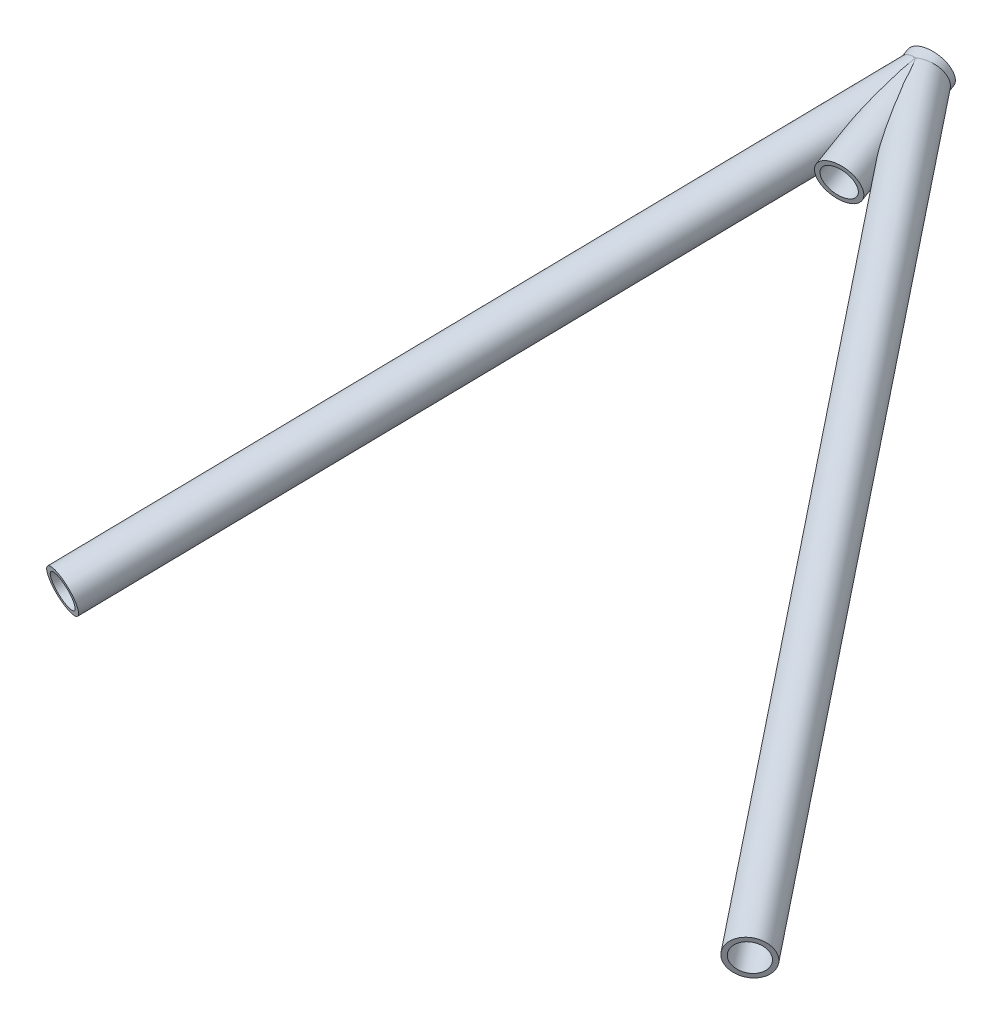
ISO-10303-21;
HEADER;
FILE_DESCRIPTION(('STEP AP214'),'2;1');
FILE_NAME('part.step','',(''),(''),'','','');
FILE_SCHEMA(('AUTOMOTIVE_DESIGN { 1 0 10303 214 1 1 1 1 }'));
ENDSEC;
DATA;
#1=APPLICATION_CONTEXT('core data for automotive mechanical design processes');
#2=APPLICATION_PROTOCOL_DEFINITION('international standard','automotive_design',2000,#1);
#3=PRODUCT_CONTEXT('',#1,'mechanical');
#4=PRODUCT('Part','Part','',(#3));
#5=PRODUCT_RELATED_PRODUCT_CATEGORY('part','',(#4));
#6=PRODUCT_DEFINITION_FORMATION('','',#4);
#7=PRODUCT_DEFINITION_CONTEXT('part definition',#1,'design');
#8=PRODUCT_DEFINITION('design','',#6,#7);
#9=PRODUCT_DEFINITION_SHAPE('','',#8);
#10=(LENGTH_UNIT() NAMED_UNIT(*) SI_UNIT(.MILLI.,.METRE.));
#11=(NAMED_UNIT(*) PLANE_ANGLE_UNIT() SI_UNIT($,.RADIAN.));
#12=(NAMED_UNIT(*) SI_UNIT($,.STERADIAN.) SOLID_ANGLE_UNIT());
#13=UNCERTAINTY_MEASURE_WITH_UNIT(LENGTH_MEASURE(1.E-05),#10,'distance_accuracy_value','');
#14=(GEOMETRIC_REPRESENTATION_CONTEXT(3) GLOBAL_UNCERTAINTY_ASSIGNED_CONTEXT((#13)) GLOBAL_UNIT_ASSIGNED_CONTEXT((#10,
#11,#12)) REPRESENTATION_CONTEXT('',''));
#15=CARTESIAN_POINT('',(0.,0.,0.));
#16=DIRECTION('',(0.,0.,1.));
#17=DIRECTION('',(1.,0.,0.));
#18=AXIS2_PLACEMENT_3D('',#15,#16,#17);
#19=CARTESIAN_POINT('',(1696.18593125395,298.313265774571,-609.984435723737));
#20=DIRECTION('',(0.586936783063146,-0.193365264339262,0.786202955498447));
#21=DIRECTION('',(0.801326519780633,0.,-0.598227221627584));
#22=AXIS2_PLACEMENT_3D('',#19,#20,#21);
#23=CYLINDRICAL_SURFACE('',#22,7.41679999999998);
#24=CARTESIAN_POINT('',(1929.45721259279,221.462462961638,-297.517103442446));
#25=DIRECTION('',(-0.586936783063146,0.193365264339262,-0.786202955498447));
#26=DIRECTION('',(-0.801326519780633,0.,0.598227221627584));
#27=AXIS2_PLACEMENT_3D('',#24,#25,#26);
#28=CIRCLE('',#27,7.41679999999998);
#29=CARTESIAN_POINT('',(1923.51393406088,221.462462961638,-293.080171785078));
#30=VERTEX_POINT('',#29);
#31=EDGE_CURVE('E67',#30,#30,#28,.T.);
#32=ORIENTED_EDGE('',*,*,#31,.F.);
#33=EDGE_LOOP('',(#32));
#34=FACE_BOUND('',#33,.T.);
#35=CARTESIAN_POINT('',(1706.02165747647,297.030905904922,-609.207426175195));
#36=CARTESIAN_POINT('',(1706.00673581778,296.841103519044,-609.227413273846));
#37=CARTESIAN_POINT('',(1705.98733985814,296.650978769853,-609.241045880463));
#38=CARTESIAN_POINT('',(1705.94016060306,296.271275535075,-609.255083840829));
#39=CARTESIAN_POINT('',(1705.9123770868,296.081697064004,-609.255488846298));
#40=CARTESIAN_POINT('',(1705.84919796562,295.704240280113,-609.242515598167));
#41=CARTESIAN_POINT('',(1705.81380072679,295.516362341264,-609.229134383668));
#42=CARTESIAN_POINT('',(1705.73641681489,295.14355209084,-609.188016254505));
#43=CARTESIAN_POINT('',(1705.69443019386,294.958619756022,-609.160279453176));
#44=CARTESIAN_POINT('',(1705.60500902473,294.592385171832,-609.089806818607));
#45=CARTESIAN_POINT('',(1705.55755916885,294.411094880365,-609.047028115088));
#46=CARTESIAN_POINT('',(1705.45885005154,294.053922003974,-608.946028945467));
#47=CARTESIAN_POINT('',(1705.40759079152,293.878039417044,-608.88780848509));
#48=CARTESIAN_POINT('',(1705.30308733114,293.53302727902,-608.755697301747));
#49=CARTESIAN_POINT('',(1705.24984467361,293.363892682493,-608.681818557565));
#50=CARTESIAN_POINT('',(1705.14330876726,293.033396564212,-608.518375530838));
#51=CARTESIAN_POINT('',(1705.09001552187,292.872034548503,-608.428812246744));
#52=CARTESIAN_POINT('',(1704.9879771568,292.565761111547,-608.23915137407));
#53=CARTESIAN_POINT('',(1704.93913696643,292.420431215509,-608.139780057658));
#54=CARTESIAN_POINT('',(1704.84496671516,292.138435012884,-607.927966292064));
#55=CARTESIAN_POINT('',(1704.79963640467,292.001768090361,-607.815524773787));
#56=CARTESIAN_POINT('',(1704.71399469042,291.737586982934,-607.578731415712));
#57=CARTESIAN_POINT('',(1704.67368147738,291.610069505586,-607.454383898296));
#58=CARTESIAN_POINT('',(1704.59921102269,291.364273460401,-607.19516722167));
#59=CARTESIAN_POINT('',(1704.56505451786,291.245995999343,-607.060296805872));
#60=CARTESIAN_POINT('',(1704.49602406218,290.990197697765,-606.746909387567));
#61=CARTESIAN_POINT('',(1704.46308950023,290.855219295926,-606.565886912209));
#62=CARTESIAN_POINT('',(1704.40863425189,290.598581230814,-606.193029772949));
#63=CARTESIAN_POINT('',(1704.38711699707,290.476925580502,-606.001191877536));
#64=CARTESIAN_POINT('',(1704.35524231705,290.245407469113,-605.609097016551));
#65=CARTESIAN_POINT('',(1704.3449108679,290.135572989478,-605.40882157173));
#66=CARTESIAN_POINT('',(1704.33474768124,289.926576611459,-605.002592836891));
#67=CARTESIAN_POINT('',(1704.33491552798,289.827414290628,-604.796639772022));
#68=CARTESIAN_POINT('',(1704.34546053741,289.624377059148,-604.350148388296));
#69=CARTESIAN_POINT('',(1704.35733891784,289.521962016027,-604.108986924925));
#70=CARTESIAN_POINT('',(1704.39194877607,289.327304572146,-603.623312143065));
#71=CARTESIAN_POINT('',(1704.41468461181,289.235066274433,-603.378797516998));
#72=CARTESIAN_POINT('',(1704.46949120538,289.059033999311,-602.887385294032));
#73=CARTESIAN_POINT('',(1704.50157641049,288.975253363104,-602.640484585225));
#74=CARTESIAN_POINT('',(1704.57367149723,288.814977347645,-602.145539495427));
#75=CARTESIAN_POINT('',(1704.61368041333,288.738481082462,-601.897495257369));
#76=CARTESIAN_POINT('',(1704.70070277427,288.591242530618,-601.399212768991));
#77=CARTESIAN_POINT('',(1704.74775842362,288.520539183174,-601.148970493799));
#78=CARTESIAN_POINT('',(1704.8476641574,288.384570506553,-600.648173056871));
#79=CARTESIAN_POINT('',(1704.90051435279,288.319305281554,-600.397617889236));
#80=CARTESIAN_POINT('',(1705.01110306714,288.193603704696,-599.896632614133));
#81=CARTESIAN_POINT('',(1705.06883717548,288.133163089674,-599.646202594999));
#82=CARTESIAN_POINT('',(1705.18852293979,288.016527603164,-599.145367932158));
#83=CARTESIAN_POINT('',(1705.25047460521,287.960332741183,-598.894963288508));
#84=CARTESIAN_POINT('',(1705.38808010555,287.843199643747,-598.354660789383));
#85=CARTESIAN_POINT('',(1705.46435165202,287.782916286716,-598.064778625151));
#86=CARTESIAN_POINT('',(1705.62098996646,287.667023501027,-597.485182064215));
#87=CARTESIAN_POINT('',(1705.70135690703,287.611414269645,-597.195467675104));
#88=CARTESIAN_POINT('',(1705.94765250895,287.451033614131,-596.326516883562));
#89=CARTESIAN_POINT('',(1706.11875695,287.352724913273,-595.74754613239));
#90=CARTESIAN_POINT('',(1706.47110520859,287.171548314561,-594.589550732133));
#91=CARTESIAN_POINT('',(1706.65236090523,287.088699019974,-594.010526846369));
#92=CARTESIAN_POINT('',(1707.02209947316,286.93802506366,-592.852894680539));
#93=CARTESIAN_POINT('',(1707.21058169521,286.870199055929,-592.274286367874));
#94=CARTESIAN_POINT('',(1707.59246434981,286.749890463263,-591.117994085909));
#95=CARTESIAN_POINT('',(1707.78585763146,286.697386820126,-590.540309943514));
#96=CARTESIAN_POINT('',(1708.17618712582,286.608601588453,-589.384831406686));
#97=CARTESIAN_POINT('',(1708.37312360939,286.572321245674,-588.807037007195));
#98=CARTESIAN_POINT('',(1708.76884935907,286.517887406104,-587.651988106915));
#99=CARTESIAN_POINT('',(1708.96763610266,286.499712088531,-587.074733795968));
#100=CARTESIAN_POINT('',(1709.36585764206,286.484402892454,-585.920230744267));
#101=CARTESIAN_POINT('',(1709.56529232166,286.487265428812,-585.342982019326));
#102=CARTESIAN_POINT('',(1709.92434349182,286.515732490038,-584.301544890679));
#103=CARTESIAN_POINT('',(1710.08412654167,286.536784393966,-583.837302363674));
#104=CARTESIAN_POINT('',(1710.32253589936,286.583910962291,-583.141336189893));
#105=CARTESIAN_POINT('',(1710.401829734,286.602222856646,-582.90931082402));
#106=CARTESIAN_POINT('',(1710.55977926024,286.64474160028,-582.445580578367));
#107=CARTESIAN_POINT('',(1710.6384349676,286.668948303468,-582.213875690787));
#108=CARTESIAN_POINT('',(1710.79460151518,286.724031429803,-581.751758482221));
#109=CARTESIAN_POINT('',(1710.87211535122,286.754884755291,-581.521344450945));
#110=CARTESIAN_POINT('',(1711.02595160608,286.824433960921,-581.061307595501));
#111=CARTESIAN_POINT('',(1711.10227412188,286.86312919911,-580.831684708133));
#112=CARTESIAN_POINT('',(1711.25320225255,286.949809507487,-580.373947594193));
#113=CARTESIAN_POINT('',(1711.32780993863,286.997782631775,-580.145831813581));
#114=CARTESIAN_POINT('',(1711.47476981037,287.105072688683,-579.691583083834));
#115=CARTESIAN_POINT('',(1711.54712283632,287.164385334939,-579.465449419127));
#116=CARTESIAN_POINT('',(1711.66234858359,287.272609602529,-579.099760179352));
#117=CARTESIAN_POINT('',(1711.70619201726,287.317205412571,-578.959235356503));
#118=CARTESIAN_POINT('',(1711.79226987723,287.413056832389,-578.67990618022));
#119=CARTESIAN_POINT('',(1711.83450387985,287.464314180375,-578.541102286222));
#120=CARTESIAN_POINT('',(1711.91678843494,287.574642384202,-578.266247417052));
#121=CARTESIAN_POINT('',(1711.95684273,287.633699209502,-578.130191992748));
#122=CARTESIAN_POINT('',(1712.0341229033,287.76129777923,-577.86182145355));
#123=CARTESIAN_POINT('',(1712.07135048488,287.829833740236,-577.729504116803));
#124=CARTESIAN_POINT('',(1712.14415679505,287.983104737118,-577.462361580691));
#125=CARTESIAN_POINT('',(1712.17949155459,288.068578983069,-577.327886500858));
#126=CARTESIAN_POINT('',(1712.24394632056,288.255738715878,-577.068864806687));
#127=CARTESIAN_POINT('',(1712.27307051578,288.357413194898,-576.944311536202));
#128=CARTESIAN_POINT('',(1712.31676178159,288.555357291404,-576.737394655839));
#129=CARTESIAN_POINT('',(1712.33312563671,288.647804562354,-576.651807160795));
#130=CARTESIAN_POINT('',(1712.35855524456,288.845109744886,-576.495046582663));
#131=CARTESIAN_POINT('',(1712.36763565059,288.949942248802,-576.423844774669));
#132=CARTESIAN_POINT('',(1712.37606554908,289.152573284875,-576.31106599501));
#133=CARTESIAN_POINT('',(1712.37677858194,289.24865718231,-576.266534741664));
#134=CARTESIAN_POINT('',(1712.37142939253,289.446525748462,-576.193388794709));
#135=CARTESIAN_POINT('',(1712.365370577,289.548307526266,-576.164766108757));
#136=CARTESIAN_POINT('',(1712.34670248247,289.754335666234,-576.1242603837));
#137=CARTESIAN_POINT('',(1712.33410436199,289.858577542222,-576.11234895669));
#138=CARTESIAN_POINT('',(1712.30323170095,290.066821202277,-576.104097505337));
#139=CARTESIAN_POINT('',(1712.2849515195,290.17082264383,-576.107773000996));
#140=CARTESIAN_POINT('',(1712.23374349447,290.427091717086,-576.13364890604));
#141=CARTESIAN_POINT('',(1712.19803322785,290.577943414102,-576.164070528728));
#142=CARTESIAN_POINT('',(1712.11990691476,290.871661501556,-576.2468419912));
#143=CARTESIAN_POINT('',(1712.07747193579,291.014503757398,-576.299254451012));
#144=CARTESIAN_POINT('',(1711.99101913826,291.283312743292,-576.416036696457));
#145=CARTESIAN_POINT('',(1711.94725734547,291.40977722868,-576.479477794236));
#146=CARTESIAN_POINT('',(1711.85710419034,291.656081683409,-576.616653503584));
#147=CARTESIAN_POINT('',(1711.81071033497,291.775915152449,-576.690397974325));
#148=CARTESIAN_POINT('',(1711.71600798229,292.00991252984,-576.845839760501));
#149=CARTESIAN_POINT('',(1711.6676951672,292.124062178366,-576.927555692528));
#150=CARTESIAN_POINT('',(1711.56980114917,292.347085047603,-577.097028804988));
#151=CARTESIAN_POINT('',(1711.52022050266,292.45596052433,-577.184783362827));
#152=CARTESIAN_POINT('',(1711.38715304752,292.739401042865,-577.424522917533));
#153=CARTESIAN_POINT('',(1711.30284509883,292.909995013015,-577.580740213895));
#154=CARTESIAN_POINT('',(1711.13265204176,293.241122300947,-577.902754895929));
#155=CARTESIAN_POINT('',(1711.04676604302,293.401649698626,-578.068557810729));
#156=CARTESIAN_POINT('',(1710.87387441638,293.714609589258,-578.407710368127));
#157=CARTESIAN_POINT('',(1710.78686695639,293.867025959006,-578.581073880676));
#158=CARTESIAN_POINT('',(1710.61227074065,294.164767523639,-578.933511090491));
#159=CARTESIAN_POINT('',(1710.52468191809,294.31009188673,-579.112585453506));
#160=CARTESIAN_POINT('',(1710.34873284269,294.595385174957,-579.476300230731));
#161=CARTESIAN_POINT('',(1710.2603709514,294.735322101025,-579.660964865286));
#162=CARTESIAN_POINT('',(1710.0835185762,295.009834312928,-580.034179027311));
#163=CARTESIAN_POINT('',(1709.995028087,295.144409371163,-580.222728719179));
#164=CARTESIAN_POINT('',(1709.81817770761,295.408656306455,-580.602883213475));
#165=CARTESIAN_POINT('',(1709.72981779317,295.538334138427,-580.794483874426));
#166=CARTESIAN_POINT('',(1709.5532326434,295.793468518336,-581.180529418666));
#167=CARTESIAN_POINT('',(1709.46500740763,295.918925080448,-581.374974292404));
#168=CARTESIAN_POINT('',(1709.26753189215,296.195839263943,-581.813575179307));
#169=CARTESIAN_POINT('',(1709.15834361105,296.346268764314,-582.058408147956));
#170=CARTESIAN_POINT('',(1708.94047925172,296.641904198261,-582.551437404445));
#171=CARTESIAN_POINT('',(1708.83180319474,296.787109916689,-582.799633830235));
#172=CARTESIAN_POINT('',(1708.50672987952,297.215720168797,-583.548754145803));
#173=CARTESIAN_POINT('',(1708.29131526716,297.492079215525,-584.05414730699));
#174=CARTESIAN_POINT('',(1707.86394908448,298.029358806916,-585.075455900364));
#175=CARTESIAN_POINT('',(1707.65200262478,298.290257834289,-585.591384713585));
#176=CARTESIAN_POINT('',(1707.23308990091,298.798174372415,-586.631950672212));
#177=CARTESIAN_POINT('',(1707.02612319946,299.045193104549,-587.156587046127));
#178=CARTESIAN_POINT('',(1706.61935295359,299.525794468289,-588.212153464212));
#179=CARTESIAN_POINT('',(1706.41952630141,299.759422274003,-588.743054047122));
#180=CARTESIAN_POINT('',(1706.0281330771,300.214901758383,-589.812954910295));
#181=CARTESIAN_POINT('',(1705.83656722131,300.436752416183,-590.351955887538));
#182=CARTESIAN_POINT('',(1705.46447674254,300.86852222511,-591.43777069037));
#183=CARTESIAN_POINT('',(1705.28394023396,301.07845420233,-591.98457529332));
#184=CARTESIAN_POINT('',(1705.02404590805,301.38402632937,-592.811594497165));
#185=CARTESIAN_POINT('',(1704.93923824896,301.48432291872,-593.088383963408));
#186=CARTESIAN_POINT('',(1704.77388372001,301.681605867048,-593.644400902294));
#187=CARTESIAN_POINT('',(1704.69333675348,301.778592301101,-593.923628319463));
#188=CARTESIAN_POINT('',(1704.51192637859,301.999837866402,-594.575656713254));
#189=CARTESIAN_POINT('',(1704.41294215486,302.122745169429,-594.949446314826));
#190=CARTESIAN_POINT('',(1704.22590400146,302.361235219671,-595.70216356258));
#191=CARTESIAN_POINT('',(1704.13785201856,302.476816660527,-596.081092110605));
#192=CARTESIAN_POINT('',(1703.97560387456,302.698979875966,-596.844663910848));
#193=CARTESIAN_POINT('',(1703.90140957647,302.805560439425,-597.229307923957));
#194=CARTESIAN_POINT('',(1703.80350158889,302.956577499446,-597.810778757054));
#195=CARTESIAN_POINT('',(1703.77309814692,303.0054371836,-598.005336760058));
#196=CARTESIAN_POINT('',(1703.71736693563,303.099709635623,-598.396002873596));
#197=CARTESIAN_POINT('',(1703.69203886101,303.145122610715,-598.592110890157));
#198=CARTESIAN_POINT('',(1703.63920424214,303.247239092256,-599.055441149856));
#199=CARTESIAN_POINT('',(1703.61408758233,303.302265615709,-599.323317975052));
#200=CARTESIAN_POINT('',(1703.57632486432,303.402974452684,-599.861780445373));
#201=CARTESIAN_POINT('',(1703.56368020701,303.448655716066,-600.132366391346));
#202=CARTESIAN_POINT('',(1703.55302492076,303.527957835842,-600.675088985327));
#203=CARTESIAN_POINT('',(1703.55498424677,303.561603304246,-600.947221299288));
#204=CARTESIAN_POINT('',(1703.57560953296,303.613579630977,-601.492329313605));
#205=CARTESIAN_POINT('',(1703.59426754657,303.631917765739,-601.765304551261));
#206=CARTESIAN_POINT('',(1703.64166067538,303.646649213793,-602.229214343993));
#207=CARTESIAN_POINT('',(1703.66576557641,303.647938111784,-602.420468216501));
#208=CARTESIAN_POINT('',(1703.7232837008,303.639386832468,-602.801301179637));
#209=CARTESIAN_POINT('',(1703.75669390253,303.629550264671,-602.990880793351));
#210=CARTESIAN_POINT('',(1703.83263666698,303.597264495231,-603.36696882085));
#211=CARTESIAN_POINT('',(1703.87516104348,303.574826582806,-603.553479829994));
#212=CARTESIAN_POINT('',(1703.96867035452,303.516035149325,-603.922161590667));
#213=CARTESIAN_POINT('',(1704.01965520963,303.479681758911,-604.104332382926));
#214=CARTESIAN_POINT('',(1704.12921348921,303.391810975629,-604.464020979565));
#215=CARTESIAN_POINT('',(1704.18783416722,303.340196378838,-604.641500759702));
#216=CARTESIAN_POINT('',(1704.31066257574,303.221380345888,-604.989171276509));
#217=CARTESIAN_POINT('',(1704.37487047642,303.154178434865,-605.159361790927));
#218=CARTESIAN_POINT('',(1704.50685022478,303.004123904674,-605.491409264894));
#219=CARTESIAN_POINT('',(1704.57462459378,302.921260103077,-605.653260164318));
#220=CARTESIAN_POINT('',(1704.71149643146,302.740345560522,-605.967632819523));
#221=CARTESIAN_POINT('',(1704.7805938602,302.642295277433,-606.120154856373));
#222=CARTESIAN_POINT('',(1704.91207926615,302.440813402789,-606.402634675259));
#223=CARTESIAN_POINT('',(1704.97453495645,302.338562260688,-606.533406155521));
#224=CARTESIAN_POINT('',(1705.09725023908,302.122786528703,-606.786375396151));
#225=CARTESIAN_POINT('',(1705.15750999158,302.009262763299,-606.908573782442));
#226=CARTESIAN_POINT('',(1705.27449711503,301.771795643232,-607.144226055896));
#227=CARTESIAN_POINT('',(1705.33122431584,301.647851787407,-607.257679521963));
#228=CARTESIAN_POINT('',(1705.43998907526,301.390465951181,-607.475716984243));
#229=CARTESIAN_POINT('',(1705.49202637474,301.257023446708,-607.580300490372));
#230=CARTESIAN_POINT('',(1705.59352103876,300.972956739631,-607.786768650459));
#231=CARTESIAN_POINT('',(1705.64261233877,300.821779859197,-607.888073409145));
#232=CARTESIAN_POINT('',(1705.73344819626,300.510927862242,-608.08042097972));
#233=CARTESIAN_POINT('',(1705.77519243856,300.351252381524,-608.171463351307));
#234=CARTESIAN_POINT('',(1705.85059754308,300.024558911171,-608.343132168399));
#235=CARTESIAN_POINT('',(1705.88425818011,299.857540717134,-608.423758323696));
#236=CARTESIAN_POINT('',(1705.94295375268,299.517322246039,-608.57439571225));
#237=CARTESIAN_POINT('',(1705.96798890052,299.344122121244,-608.644407206726));
#238=CARTESIAN_POINT('',(1706.00856653463,298.997084885626,-608.771957469955));
#239=CARTESIAN_POINT('',(1706.02433090875,298.823372195914,-608.829764537273));
#240=CARTESIAN_POINT('',(1706.04716569101,298.472146667269,-608.934808525344));
#241=CARTESIAN_POINT('',(1706.05423280684,298.294632415119,-608.98204143775));
#242=CARTESIAN_POINT('',(1706.05965577032,297.936913822987,-609.065589878692));
#243=CARTESIAN_POINT('',(1706.05801127669,297.756709377892,-609.101904979462));
#244=CARTESIAN_POINT('',(1706.04616714856,297.394737048595,-609.163234889436));
#245=CARTESIAN_POINT('',(1706.03597075834,297.212969783147,-609.188253978397));
#246=CARTESIAN_POINT('',(1706.02165747647,297.030905904922,-609.207426175195));
#247=B_SPLINE_CURVE_WITH_KNOTS('',3,(#35,#36,#37,#38,#39,#40,#41,#42,#43,#44,#45,#46,#47,#48,
#49,#50,#51,#52,#53,#54,#55,#56,#57,#58,#59,#60,#61,#62,#63,#64,#65,#66,#67,#68,#69,#70,#71,#72,
#73,#74,#75,#76,#77,#78,#79,#80,#81,#82,#83,#84,#85,#86,#87,#88,#89,#90,#91,#92,#93,#94,#95,#96,
#97,#98,#99,#100,#101,#102,#103,#104,#105,#106,#107,#108,#109,#110,#111,#112,#113,#114,#115,
#116,#117,#118,#119,#120,#121,#122,#123,#124,#125,#126,#127,#128,#129,#130,#131,#132,#133,#134,
#135,#136,#137,#138,#139,#140,#141,#142,#143,#144,#145,#146,#147,#148,#149,#150,#151,#152,#153,
#154,#155,#156,#157,#158,#159,#160,#161,#162,#163,#164,#165,#166,#167,#168,#169,#170,#171,#172,
#173,#174,#175,#176,#177,#178,#179,#180,#181,#182,#183,#184,#185,#186,#187,#188,#189,#190,#191,
#192,#193,#194,#195,#196,#197,#198,#199,#200,#201,#202,#203,#204,#205,#206,#207,#208,#209,#210,
#211,#212,#213,#214,#215,#216,#217,#218,#219,#220,#221,#222,#223,#224,#225,#226,#227,#228,#229,
#230,#231,#232,#233,#234,#235,#236,#237,#238,#239,#240,#241,#242,#243,#244,#245,#246),
.UNSPECIFIED.,.T.,.F.,(4,2,2,2,2,2,2,2,2,2,2,2,2,2,2,2,2,2,2,2,2,2,2,2,2,2,2,2,2,2,2,2,2,2,2,2,
2,2,2,2,2,2,2,2,2,2,2,2,2,2,2,2,2,2,2,2,2,2,2,2,2,2,2,2,2,2,2,2,2,2,2,2,2,2,2,2,2,2,2,2,2,2,2,2,
2,2,2,2,2,2,2,2,2,2,2,2,2,2,2,2,2,2,2,2,2,4),(0.,0.574151275382462,1.14831766800678,
1.72260740137623,2.296892600893,2.87282799279553,3.44876317115333,4.02425933197849,
4.59971887104737,5.14712857839256,5.69449932114901,6.24167209321343,6.78891030602429,
7.47242075871127,8.15613652935075,8.84143666399751,9.52670966171098,10.3129926627842,
11.0995915267926,11.8874124032728,12.6751373416048,13.4677842361595,14.2604463120172,
15.0524000320317,15.8443555253407,16.7615301813815,17.6787435284927,19.5134019947082,
21.3502541791536,23.1869417250939,25.0210930128394,26.8553851173875,28.6874637870278,
30.5192302527021,31.9931047554359,32.7306971522825,33.4682712713172,34.2033224460803,
34.9383134725017,35.6723643744238,36.4061383500634,36.8674478385666,37.3288779401915,
37.7894889992185,38.2498202593181,38.7385918041611,39.2270326407056,39.6069008107843,
39.9860028075153,40.3022625540152,40.6183632700834,40.9339263637531,41.2498037394128,
41.7210220392224,42.1935913627706,42.6372242234307,43.0812845358824,43.5264079361407,
43.9713392233644,44.70935405677,45.4477989196802,46.1876606828538,46.927609013856,
47.6714288978679,48.4152803217858,49.1581960318027,49.9011092472057,50.8232310969298,
51.745390881927,53.5899441500655,55.4370071241908,57.2839073127778,59.1241577876502,
60.9645675194093,62.8029576451338,63.7220281708869,64.6410778379327,65.8580786438684,
67.0752958603398,68.2926766009728,68.9012654897403,69.5098177602161,70.3332966156811,
71.1568679558482,71.9787454149558,72.8002319667779,73.3780667227969,73.9557140616899,
74.5328447249371,75.1099699700809,75.6908533584024,76.2717544454759,76.8530718675366,
77.4343717664691,77.9658767475643,78.4973428829746,79.0288345942676,79.5603556525165,
80.12518725201,80.6900430761221,81.2549146343663,81.8197722892924,82.3704935408063,
82.9214232021492,83.4723744464766,84.0231167746117),.UNSPECIFIED.);
#248=CARTESIAN_POINT('',(1706.02165747647,297.030905904922,-609.207426175195));
#249=VERTEX_POINT('',#248);
#250=EDGE_CURVE('E81',#249,#249,#247,.T.);
#251=ORIENTED_EDGE('',*,*,#250,.T.);
#252=EDGE_LOOP('',(#251));
#253=FACE_BOUND('',#252,.T.);
#254=ADVANCED_FACE('F63',(#34,#253),#23,.F.);
#255=CARTESIAN_POINT('',(1695.27005223557,299.62724687487,-614.720955468418));
#256=DIRECTION('',(0.18317580367567,-0.262796220059855,0.94730394893615));
#257=DIRECTION('',(0.,-0.963608030897897,-0.267319215151245));
#258=AXIS2_PLACEMENT_3D('',#255,#256,#257);
#259=CYLINDRICAL_SURFACE('',#258,9.52499999999994);
#260=ORIENTED_EDGE('',*,*,#250,.F.);
#261=EDGE_LOOP('',(#260));
#262=FACE_BOUND('',#261,.T.);
#263=CARTESIAN_POINT('',(1696.18593125395,298.313265774571,-609.984435723738));
#264=DIRECTION('',(0.394737380314413,-0.233815149177805,0.88854537115303));
#265=DIRECTION('',(0.917171793543887,0.157717356150483,-0.365952369436776));
#266=AXIS2_PLACEMENT_3D('',#263,#264,#265);
#267=ELLIPSE('',#266,9.76447759000189,9.52499999999998);
#268=CARTESIAN_POINT('',(1695.66611562887,307.451587268054,-607.348814924447));
#269=VERTEX_POINT('',#268);
#270=CARTESIAN_POINT('',(1696.70574687903,289.174944281087,-612.620056523029));
#271=VERTEX_POINT('',#270);
#272=EDGE_CURVE('E72',#269,#271,#267,.F.);
#273=ORIENTED_EDGE('',*,*,#272,.T.);
#274=CARTESIAN_POINT('',(1696.18593125395,298.313265774571,-609.984435723738));
#275=DIRECTION('',(0.917171793543887,0.157717356150483,-0.365952369436776));
#276=DIRECTION('',(0.394737380314413,-0.233815149177805,0.88854537115303));
#277=AXIS2_PLACEMENT_3D('',#274,#275,#276);
#278=ELLIPSE('',#277,43.2734304674934,9.52499999999998);
#279=EDGE_CURVE('E13',#271,#269,#278,.F.);
#280=ORIENTED_EDGE('',*,*,#279,.T.);
#281=EDGE_LOOP('',(#273,#280));
#282=FACE_BOUND('',#281,.T.);
#283=ADVANCED_FACE('F79',(#262,#282),#259,.F.);
#284=CARTESIAN_POINT('',(1696.18593125395,298.313265774571,-609.984435723737));
#285=DIRECTION('',(0.586936783063146,-0.193365264339262,0.786202955498447));
#286=DIRECTION('',(0.801326519780633,0.,-0.598227221627584));
#287=AXIS2_PLACEMENT_3D('',#284,#285,#286);
#288=CYLINDRICAL_SURFACE('',#287,9.52500000000001);
#289=CARTESIAN_POINT('',(1929.45721259279,221.462462961638,-297.517103442446));
#290=DIRECTION('',(-0.586936783063146,0.193365264339262,-0.786202955498447));
#291=DIRECTION('',(-0.801326519780633,0.,0.598227221627584));
#292=AXIS2_PLACEMENT_3D('',#289,#290,#291);
#293=CIRCLE('',#292,9.52500000000001);
#294=CARTESIAN_POINT('',(1921.82457749188,221.462462961638,-291.818989156443));
#295=VERTEX_POINT('',#294);
#296=EDGE_CURVE('E107',#295,#295,#293,.T.);
#297=ORIENTED_EDGE('',*,*,#296,.T.);
#298=EDGE_LOOP('',(#297));
#299=FACE_BOUND('',#298,.T.);
#300=ORIENTED_EDGE('',*,*,#272,.F.);
#301=ORIENTED_EDGE('',*,*,#279,.F.);
#302=EDGE_LOOP('',(#300,#301));
#303=FACE_BOUND('',#302,.T.);
#304=ADVANCED_FACE('F65',(#299,#303),#288,.T.);
#305=CARTESIAN_POINT('',(1929.45721259279,221.462462961638,-297.517103442446));
#306=DIRECTION('',(-0.586936783063146,0.193365264339262,-0.786202955498447));
#307=DIRECTION('',(-0.801326519780633,0.,0.598227221627584));
#308=AXIS2_PLACEMENT_3D('',#305,#306,#307);
#309=PLANE('',#308);
#310=ORIENTED_EDGE('',*,*,#31,.T.);
#311=EDGE_LOOP('',(#310));
#312=FACE_BOUND('',#311,.T.);
#313=ORIENTED_EDGE('',*,*,#296,.F.);
#314=EDGE_LOOP('',(#313));
#315=FACE_BOUND('',#314,.T.);
#316=ADVANCED_FACE('F84',(#312,#315),#309,.F.);
#317=CLOSED_SHELL('',(#254,#283,#304,#316));
#318=MANIFOLD_SOLID_BREP('B2',#317);
#319=CARTESIAN_POINT('',(1600.,194.785610189008,-270.));
#320=DIRECTION('',(0.261244511464905,0.281184903592084,-0.923410177126814));
#321=DIRECTION('',(0.,0.956631443980582,0.291301013365261));
#322=AXIS2_PLACEMENT_3D('',#319,#320,#321);
#323=CYLINDRICAL_SURFACE('',#322,7.41679999999998);
#324=CARTESIAN_POINT('',(1609.14355790127,204.627081814731,-302.319356199439));
#325=DIRECTION('',(0.261244511464905,0.281184903592084,-0.923410177126814));
#326=DIRECTION('',(0.,0.956631443980581,0.291301013365261));
#327=AXIS2_PLACEMENT_3D('',#324,#325,#326);
#328=CIRCLE('',#327,7.41679999999998);
#329=CARTESIAN_POINT('',(1609.14355790127,211.722225908446,-300.158834843511));
#330=VERTEX_POINT('',#329);
#331=EDGE_CURVE('E189',#330,#330,#328,.T.);
#332=ORIENTED_EDGE('',*,*,#331,.F.);
#333=EDGE_LOOP('',(#332));
#334=FACE_BOUND('',#333,.T.);
#335=CARTESIAN_POINT('',(1692.35451797443,301.284550700558,-594.281176205588));
#336=CARTESIAN_POINT('',(1692.40321256167,301.19489699609,-593.986749530908));
#337=CARTESIAN_POINT('',(1692.44833392335,301.101948032664,-593.692735606924));
#338=CARTESIAN_POINT('',(1692.53255673058,300.910417652576,-593.105669620011));
#339=CARTESIAN_POINT('',(1692.57165764861,300.811835743391,-592.812617643568));
#340=CARTESIAN_POINT('',(1692.64477115754,300.609698549196,-592.22748831856));
#341=CARTESIAN_POINT('',(1692.67878200232,300.506141573557,-591.935411337899));
#342=CARTESIAN_POINT('',(1692.74245671099,300.294575305461,-591.352393895294));
#343=CARTESIAN_POINT('',(1692.77212040604,300.186565840279,-591.061453477921));
#344=CARTESIAN_POINT('',(1692.85565928255,299.856040353689,-590.189426959023));
#345=CARTESIAN_POINT('',(1692.90396271021,299.627373076613,-589.610129258401));
#346=CARTESIAN_POINT('',(1692.98960354427,299.155359138829,-588.456898481575));
#347=CARTESIAN_POINT('',(1693.02694290721,298.912015106544,-587.882964465941));
#348=CARTESIAN_POINT('',(1693.09368746726,298.408752980053,-586.735632212745));
#349=CARTESIAN_POINT('',(1693.12301659658,298.148703123124,-586.162287370279));
#350=CARTESIAN_POINT('',(1693.17534822545,297.613681295601,-585.022246750042));
#351=CARTESIAN_POINT('',(1693.19835018428,297.338708052062,-584.455551544506));
#352=CARTESIAN_POINT('',(1693.23955544476,296.773219693495,-583.331082260448));
#353=CARTESIAN_POINT('',(1693.25776744769,296.482733929654,-582.773293758744));
#354=CARTESIAN_POINT('',(1693.29069950934,295.883773828645,-581.667390754462));
#355=CARTESIAN_POINT('',(1693.30542006517,295.575302060125,-581.119274884992));
#356=CARTESIAN_POINT('',(1693.3256781672,295.097021289804,-580.307149116838));
#357=CARTESIAN_POINT('',(1693.33212023512,294.935208505741,-580.038441270598));
#358=CARTESIAN_POINT('',(1693.34453395958,294.605688475307,-579.504654778778));
#359=CARTESIAN_POINT('',(1693.35050563145,294.437981421193,-579.239576015215));
#360=CARTESIAN_POINT('',(1693.36212452755,294.095544985388,-578.713089268));
#361=CARTESIAN_POINT('',(1693.36777095678,293.920800035183,-578.45169136843));
#362=CARTESIAN_POINT('',(1693.37886544024,293.563725131696,-577.934144729642));
#363=CARTESIAN_POINT('',(1693.38431351374,293.381395919245,-577.677995481366));
#364=CARTESIAN_POINT('',(1693.39512999131,293.009325898411,-577.17414862671));
#365=CARTESIAN_POINT('',(1693.40049868579,292.819653054926,-576.926401092177));
#366=CARTESIAN_POINT('',(1693.41138578613,292.429988104305,-576.439202455458));
#367=CARTESIAN_POINT('',(1693.41690416353,292.22999795278,-576.199749795285));
#368=CARTESIAN_POINT('',(1693.42831297223,291.818084776206,-575.73264719619));
#369=CARTESIAN_POINT('',(1693.43420205473,291.606205284953,-575.504959399402));
#370=CARTESIAN_POINT('',(1693.44357642706,291.276706065847,-575.175303674284));
#371=CARTESIAN_POINT('',(1693.44678992795,291.164974072197,-575.067439158021));
#372=CARTESIAN_POINT('',(1693.45345578117,290.937053185211,-574.856548811978));
#373=CARTESIAN_POINT('',(1693.45690808842,290.820865134657,-574.753522075338));
#374=CARTESIAN_POINT('',(1693.46416850838,290.58185817668,-574.55219176005));
#375=CARTESIAN_POINT('',(1693.46798065028,290.458972878213,-574.453966637352));
#376=CARTESIAN_POINT('',(1693.47601856145,290.207108078141,-574.265380550495));
#377=CARTESIAN_POINT('',(1693.48024466084,290.078123755754,-574.175025973264));
#378=CARTESIAN_POINT('',(1693.48919503974,289.814266466425,-574.005447157257));
#379=CARTESIAN_POINT('',(1693.49391556695,289.679441841019,-573.926148409514));
#380=CARTESIAN_POINT('',(1693.50401909068,289.402516013704,-573.781747967443));
#381=CARTESIAN_POINT('',(1693.50940093023,289.260427766872,-573.716622015935));
#382=CARTESIAN_POINT('',(1693.5198223221,288.998281083395,-573.617144449172));
#383=CARTESIAN_POINT('',(1693.52471022339,288.879593435595,-573.579230944988));
#384=CARTESIAN_POINT('',(1693.53509416451,288.638036944649,-573.519566295602));
#385=CARTESIAN_POINT('',(1693.54059039493,288.515166799481,-573.497820232384));
#386=CARTESIAN_POINT('',(1693.55228427072,288.265802772052,-573.474637949174));
#387=CARTESIAN_POINT('',(1693.55848975368,288.139282863191,-573.473456367367));
#388=CARTESIAN_POINT('',(1693.5714344696,287.888500239805,-573.495655116016));
#389=CARTESIAN_POINT('',(1693.57817262495,287.764233563228,-573.51898697485));
#390=CARTESIAN_POINT('',(1693.59117149443,287.536579444934,-573.586511623852));
#391=CARTESIAN_POINT('',(1693.59740188151,287.432407495432,-573.628093664458));
#392=CARTESIAN_POINT('',(1693.60988857766,287.232772113681,-573.728591283975));
#393=CARTESIAN_POINT('',(1693.61614490788,287.137318519956,-573.787526136193));
#394=CARTESIAN_POINT('',(1693.63044960658,286.928222146603,-573.939776842204));
#395=CARTESIAN_POINT('',(1693.63844560271,286.818244568201,-574.038079741028));
#396=CARTESIAN_POINT('',(1693.65399954518,286.615042392466,-574.250678782107));
#397=CARTESIAN_POINT('',(1693.66155641545,286.521857862588,-574.365012047077));
#398=CARTESIAN_POINT('',(1693.67537600759,286.359400448225,-574.590896724713));
#399=CARTESIAN_POINT('',(1693.68168997114,286.288627941542,-574.701390629913));
#400=CARTESIAN_POINT('',(1693.69394206882,286.156756791295,-574.928085334802));
#401=CARTESIAN_POINT('',(1693.69987987327,286.09566656528,-575.044290986426));
#402=CARTESIAN_POINT('',(1693.71141104023,285.981540616268,-575.28087500405));
#403=CARTESIAN_POINT('',(1693.71700361954,285.92852283449,-575.401261954864));
#404=CARTESIAN_POINT('',(1693.72785534109,285.829436725207,-575.644794110324));
#405=CARTESIAN_POINT('',(1693.73311460525,285.783365848355,-575.767938283989));
#406=CARTESIAN_POINT('',(1693.74617413707,285.673057838698,-576.085461377677));
#407=CARTESIAN_POINT('',(1693.75375733294,285.61300283284,-576.281298197425));
#408=CARTESIAN_POINT('',(1693.76826521507,285.504163442238,-576.676141269604));
#409=CARTESIAN_POINT('',(1693.77518953886,285.455385240413,-576.875149197098));
#410=CARTESIAN_POINT('',(1693.78844696752,285.366959840808,-577.275566841505));
#411=CARTESIAN_POINT('',(1693.79477895271,285.327329736044,-577.476980326651));
#412=CARTESIAN_POINT('',(1693.80688066342,285.255759496191,-577.881190386604));
#413=CARTESIAN_POINT('',(1693.8126503225,285.223820269084,-578.083987121813));
#414=CARTESIAN_POINT('',(1693.82369444851,285.16627341328,-578.491890488786));
#415=CARTESIAN_POINT('',(1693.82896527221,285.140710424113,-578.697003443334));
#416=CARTESIAN_POINT('',(1693.83898805354,285.095282088341,-579.10787188742));
#417=CARTESIAN_POINT('',(1693.84373999131,285.07541695973,-579.313627401238));
#418=CARTESIAN_POINT('',(1693.85273180833,285.040688191507,-579.725285314199));
#419=CARTESIAN_POINT('',(1693.85697237327,285.025817805626,-579.931187135726));
#420=CARTESIAN_POINT('',(1693.86495533487,285.000471681933,-580.343263120554));
#421=CARTESIAN_POINT('',(1693.8686977371,284.989995894901,-580.549437280778));
#422=CARTESIAN_POINT('',(1693.87866393111,284.965705240132,-581.137689361145));
#423=CARTESIAN_POINT('',(1693.88428531061,284.956649635834,-581.519977725723));
#424=CARTESIAN_POINT('',(1693.89379761111,284.949709310978,-582.28469497114));
#425=CARTESIAN_POINT('',(1693.89768831875,284.951825967397,-582.66712386349));
#426=CARTESIAN_POINT('',(1693.90366406187,284.965626299072,-583.431983203004));
#427=CARTESIAN_POINT('',(1693.90574830218,284.977314183076,-583.814413576824));
#428=CARTESIAN_POINT('',(1693.90799219322,285.00905572662,-584.578934709556));
#429=CARTESIAN_POINT('',(1693.90815179249,285.029109609845,-584.961025459112));
#430=CARTESIAN_POINT('',(1693.90638626664,285.076746749097,-585.725959442119));
#431=CARTESIAN_POINT('',(1693.90445444685,285.104353971521,-586.108801153079));
#432=CARTESIAN_POINT('',(1693.89829185962,285.166363980358,-586.873915855092));
#433=CARTESIAN_POINT('',(1693.89406106963,285.20076683339,-587.256188840532));
#434=CARTESIAN_POINT('',(1693.88304718764,285.275817703607,-588.019963957977));
#435=CARTESIAN_POINT('',(1693.87626488029,285.316463798582,-588.401466290751));
#436=CARTESIAN_POINT('',(1693.85983232755,285.403605243922,-589.163740657201));
#437=CARTESIAN_POINT('',(1693.85018207473,285.45010060947,-589.544512688979));
#438=CARTESIAN_POINT('',(1693.82769655192,285.548336377991,-590.302800920252));
#439=CARTESIAN_POINT('',(1693.81488210082,285.600041238537,-590.680322341277));
#440=CARTESIAN_POINT('',(1693.7855663154,285.708760792822,-591.434448145999));
#441=CARTESIAN_POINT('',(1693.76906507139,285.765775356462,-591.811052551932));
#442=CARTESIAN_POINT('',(1693.73178398822,285.885063970493,-592.563374785838));
#443=CARTESIAN_POINT('',(1693.71100241428,285.947340147301,-592.939092191675));
#444=CARTESIAN_POINT('',(1693.66443650012,286.077167343225,-593.689302857438));
#445=CARTESIAN_POINT('',(1693.63865222713,286.144718291433,-594.063796133748));
#446=CARTESIAN_POINT('',(1693.58125944281,286.28503497248,-594.810096943858));
#447=CARTESIAN_POINT('',(1693.54967011707,286.357783058421,-595.18190925008));
#448=CARTESIAN_POINT('',(1693.47946490604,286.509020332555,-595.923734903454));
#449=CARTESIAN_POINT('',(1693.44084858823,286.587509873963,-596.29374813843));
#450=CARTESIAN_POINT('',(1693.35516094217,286.750715341162,-597.031161228562));
#451=CARTESIAN_POINT('',(1693.3080953523,286.835427018208,-597.398562682556));
#452=CARTESIAN_POINT('',(1693.20363887942,287.011949266035,-598.13015502765));
#453=CARTESIAN_POINT('',(1693.14624990553,287.103758522458,-598.494346499337));
#454=CARTESIAN_POINT('',(1693.05888607097,287.235314917707,-598.990367142739));
#455=CARTESIAN_POINT('',(1693.03439908011,287.271448908168,-599.124132427424));
#456=CARTESIAN_POINT('',(1692.98352905863,287.34495840164,-599.390960619915));
#457=CARTESIAN_POINT('',(1692.9571460113,287.382333915596,-599.524023521518));
#458=CARTESIAN_POINT('',(1692.87491632802,287.496474415346,-599.922051803074));
#459=CARTESIAN_POINT('',(1692.81599484091,287.57524472443,-600.185823985619));
#460=CARTESIAN_POINT('',(1692.68844422931,287.739229559889,-600.709543616366));
#461=CARTESIAN_POINT('',(1692.61979832521,287.824455104027,-600.969483577627));
#462=CARTESIAN_POINT('',(1692.47125713277,288.002513766452,-601.483532890139));
#463=CARTESIAN_POINT('',(1692.39136178999,288.095346921548,-601.737642213171));
#464=CARTESIAN_POINT('',(1692.2171434869,288.291897976196,-602.242007284057));
#465=CARTESIAN_POINT('',(1692.12260263763,288.395771250691,-602.492128615562));
#466=CARTESIAN_POINT('',(1691.91833227161,288.615294232063,-602.980920293714));
#467=CARTESIAN_POINT('',(1691.8086004672,288.730945711965,-603.219588908354));
#468=CARTESIAN_POINT('',(1691.57330527775,288.97602495069,-603.680090409575));
#469=CARTESIAN_POINT('',(1691.4478139242,289.105389636328,-603.901992970339));
#470=CARTESIAN_POINT('',(1691.18079366633,289.380902631391,-604.324703084));
#471=CARTESIAN_POINT('',(1691.03927914523,289.527035890037,-604.525529248928));
#472=CARTESIAN_POINT('',(1690.79722176755,289.780938132487,-604.831487466055));
#473=CARTESIAN_POINT('',(1690.70077671223,289.883023270644,-604.944629266931));
#474=CARTESIAN_POINT('',(1690.50354186818,290.095136025409,-605.159074679214));
#475=CARTESIAN_POINT('',(1690.40275275296,290.205162412545,-605.260380116805));
#476=CARTESIAN_POINT('',(1690.1982874565,290.433320341524,-605.450172559598));
#477=CARTESIAN_POINT('',(1690.0946110804,290.551452431224,-605.538658697095));
#478=CARTESIAN_POINT('',(1689.8861226259,290.79574953886,-605.70221031976));
#479=CARTESIAN_POINT('',(1689.78131050105,290.921914886435,-605.777275253716));
#480=CARTESIAN_POINT('',(1689.57240908553,291.182026251052,-605.913811876453));
#481=CARTESIAN_POINT('',(1689.4683200043,291.315974425305,-605.975279773551));
#482=CARTESIAN_POINT('',(1689.26276712599,291.591166839237,-606.084794251783));
#483=CARTESIAN_POINT('',(1689.16130336711,291.732411184986,-606.132840637734));
#484=CARTESIAN_POINT('',(1688.96268937814,292.021708943127,-606.216032913166));
#485=CARTESIAN_POINT('',(1688.86554204878,292.169766802291,-606.251170239371));
#486=CARTESIAN_POINT('',(1688.67719771395,292.471937279461,-606.309189381039));
#487=CARTESIAN_POINT('',(1688.58600080354,292.626049994142,-606.332071000735));
#488=CARTESIAN_POINT('',(1688.41068952955,292.939992893841,-606.366407832337));
#489=CARTESIAN_POINT('',(1688.32659352449,293.099836463229,-606.377834209424));
#490=CARTESIAN_POINT('',(1688.16688507347,293.424094130003,-606.389975609348));
#491=CARTESIAN_POINT('',(1688.09127256418,293.588508193268,-606.39069071213));
#492=CARTESIAN_POINT('',(1687.94947133261,293.921096121292,-606.382196938547));
#493=CARTESIAN_POINT('',(1687.88328260208,294.089269982764,-606.372988070862));
#494=CARTESIAN_POINT('',(1687.76108425985,294.428541510592,-606.345372781587));
#495=CARTESIAN_POINT('',(1687.70507534337,294.599639375766,-606.326965732145));
#496=CARTESIAN_POINT('',(1687.60015604904,294.956401100264,-606.279952758607));
#497=CARTESIAN_POINT('',(1687.55205779496,295.142219580746,-606.25070264484));
#498=CARTESIAN_POINT('',(1687.46881761746,295.515092695849,-606.183056963812));
#499=CARTESIAN_POINT('',(1687.43367626675,295.70214738474,-606.144660992419));
#500=CARTESIAN_POINT('',(1687.37671586101,296.076374975013,-606.059287197655));
#501=CARTESIAN_POINT('',(1687.35489998819,296.263547893954,-606.012307327872));
#502=CARTESIAN_POINT('',(1687.32480893185,296.636761373772,-605.91022816345));
#503=CARTESIAN_POINT('',(1687.31653367068,296.822801941137,-605.855128915376));
#504=CARTESIAN_POINT('',(1687.31352066968,297.198290853056,-605.735301941003));
#505=CARTESIAN_POINT('',(1687.31921402954,297.387664027465,-605.670327145457));
#506=CARTESIAN_POINT('',(1687.34491344367,297.762474414998,-605.532336406722));
#507=CARTESIAN_POINT('',(1687.36491988635,297.94791152117,-605.459320245362));
#508=CARTESIAN_POINT('',(1687.41892334559,298.313410722178,-605.305338744833));
#509=CARTESIAN_POINT('',(1687.45292274655,298.493471895342,-605.22437205268));
#510=CARTESIAN_POINT('',(1687.53437764731,298.846662759104,-605.054475039203));
#511=CARTESIAN_POINT('',(1687.58183298705,299.019792532118,-604.965544812608));
#512=CARTESIAN_POINT('',(1687.68920947081,299.356841684435,-604.779961524767));
#513=CARTESIAN_POINT('',(1687.74907758019,299.520796597582,-604.683342363583));
#514=CARTESIAN_POINT('',(1687.88038764013,299.838679790484,-604.481808980022));
#515=CARTESIAN_POINT('',(1687.95182966716,299.992608003985,-604.376894702843));
#516=CARTESIAN_POINT('',(1688.10495036143,300.288753643728,-604.158502703358));
#517=CARTESIAN_POINT('',(1688.18662456849,300.430976127967,-604.045028720718));
#518=CARTESIAN_POINT('',(1688.35860797913,300.70218777803,-603.809154299508));
#519=CARTESIAN_POINT('',(1688.44891664425,300.831177768003,-603.686754417675));
#520=CARTESIAN_POINT('',(1688.63175062566,301.06865485056,-603.43882501276));
#521=CARTESIAN_POINT('',(1688.72396588041,301.17782556836,-603.313721695284));
#522=CARTESIAN_POINT('',(1688.9125027817,301.381737013165,-603.055128718716));
#523=CARTESIAN_POINT('',(1689.00882419888,301.476478544865,-602.92163952788));
#524=CARTESIAN_POINT('',(1689.20336213137,301.650676382459,-602.646577357794));
#525=CARTESIAN_POINT('',(1689.30157668307,301.730147677719,-602.5050124846));
#526=CARTESIAN_POINT('',(1689.49784504946,301.873581140937,-602.21413818531));
#527=CARTESIAN_POINT('',(1689.5958988703,301.937543917599,-602.064829063453));
#528=CARTESIAN_POINT('',(1689.78322835782,302.046296067274,-601.769644973754));
#529=CARTESIAN_POINT('',(1689.87264661582,302.09209557598,-601.624230294754));
#530=CARTESIAN_POINT('',(1690.04824054376,302.170924863803,-601.328108685737));
#531=CARTESIAN_POINT('',(1690.13441639313,302.20395535042,-601.177402049439));
#532=CARTESIAN_POINT('',(1690.30254396308,302.258122467063,-600.871450245956));
#533=CARTESIAN_POINT('',(1690.3844928491,302.279251207709,-600.716202139884));
#534=CARTESIAN_POINT('',(1690.54344486493,302.310659773874,-600.402098355184));
#535=CARTESIAN_POINT('',(1690.62044649621,302.320936326662,-600.24324160303));
#536=CARTESIAN_POINT('',(1690.81691817504,302.335302768077,-599.819689632759));
#537=CARTESIAN_POINT('',(1690.93186972516,302.33116942394,-599.552601067419));
#538=CARTESIAN_POINT('',(1691.14732818237,302.301910771112,-599.013774277233));
#539=CARTESIAN_POINT('',(1691.24782440195,302.276770023215,-598.74203277667));
#540=CARTESIAN_POINT('',(1691.43569437626,302.209854538931,-598.195335876955));
#541=CARTESIAN_POINT('',(1691.52303203251,302.168035152294,-597.920373789561));
#542=CARTESIAN_POINT('',(1691.68581367413,302.071333237368,-597.369374054294));
#543=CARTESIAN_POINT('',(1691.76126043561,302.01645376569,-597.093336672932));
#544=CARTESIAN_POINT('',(1691.88551666583,301.910321818406,-596.605368642333));
#545=CARTESIAN_POINT('',(1691.93643541389,301.861206899738,-596.39349660937));
#546=CARTESIAN_POINT('',(1692.03293738896,301.757798559072,-595.969821873923));
#547=CARTESIAN_POINT('',(1692.0785209398,301.703505451745,-595.75801916801));
#548=CARTESIAN_POINT('',(1692.16487214158,301.590622007871,-595.33516310327));
#549=CARTESIAN_POINT('',(1692.20565128304,301.532042490838,-595.124109177713));
#550=CARTESIAN_POINT('',(1692.28306821038,301.41105347401,-594.702358598073));
#551=CARTESIAN_POINT('',(1692.31970619885,301.348644161804,-594.491661927011));
#552=CARTESIAN_POINT('',(1692.35451797443,301.284550700558,-594.281176205588));
#553=B_SPLINE_CURVE_WITH_KNOTS('',3,(#335,#336,#337,#338,#339,#340,#341,#342,#343,#344,#345,
#346,#347,#348,#349,#350,#351,#352,#353,#354,#355,#356,#357,#358,#359,#360,#361,#362,#363,#364,
#365,#366,#367,#368,#369,#370,#371,#372,#373,#374,#375,#376,#377,#378,#379,#380,#381,#382,#383,
#384,#385,#386,#387,#388,#389,#390,#391,#392,#393,#394,#395,#396,#397,#398,#399,#400,#401,#402,
#403,#404,#405,#406,#407,#408,#409,#410,#411,#412,#413,#414,#415,#416,#417,#418,#419,#420,#421,
#422,#423,#424,#425,#426,#427,#428,#429,#430,#431,#432,#433,#434,#435,#436,#437,#438,#439,#440,
#441,#442,#443,#444,#445,#446,#447,#448,#449,#450,#451,#452,#453,#454,#455,#456,#457,#458,#459,
#460,#461,#462,#463,#464,#465,#466,#467,#468,#469,#470,#471,#472,#473,#474,#475,#476,#477,#478,
#479,#480,#481,#482,#483,#484,#485,#486,#487,#488,#489,#490,#491,#492,#493,#494,#495,#496,#497,
#498,#499,#500,#501,#502,#503,#504,#505,#506,#507,#508,#509,#510,#511,#512,#513,#514,#515,#516,
#517,#518,#519,#520,#521,#522,#523,#524,#525,#526,#527,#528,#529,#530,#531,#532,#533,#534,#535,
#536,#537,#538,#539,#540,#541,#542,#543,#544,#545,#546,#547,#548,#549,#550,#551,#552),
.UNSPECIFIED.,.T.,.F.,(4,2,2,2,2,2,2,2,2,2,2,2,2,2,2,2,2,2,2,2,2,2,2,2,2,2,2,2,2,2,2,2,2,2,2,2,
2,2,2,2,2,2,2,2,2,2,2,2,2,2,2,2,2,2,2,2,2,2,2,2,2,2,2,2,2,2,2,2,2,2,2,2,2,2,2,2,2,2,2,2,2,2,2,2,
2,2,2,2,2,2,2,2,2,2,2,2,2,2,2,2,2,2,2,2,2,2,2,2,4),(0.,0.934781697191407,1.86964525337195,
2.80482877411667,3.74004860750535,5.61366294268886,7.4869427276119,9.37743779607622,
11.2680943754957,13.1552923440259,15.0422214517443,15.9833614630241,16.9244708049725,
17.8677905772149,18.8110184214239,19.746975538678,20.6827558955923,21.61530886461,
22.0812070923993,22.5470176343342,23.0188612554401,23.4910842770888,23.9599526767736,
24.4280121697918,24.8012195559557,25.1745442045568,25.5524882741921,25.9296864205793,
26.2649038599767,26.600495030028,27.0411821131333,27.4829071226496,27.8764375338796,
28.2703082165238,28.6650418954311,29.0596303622105,29.6740913114371,30.2888883664931,
30.9048250221405,31.5208343594754,32.141042373515,32.7612741129511,33.3806647208559,
34.0000483913801,35.1471360433961,36.2943650768448,37.4420988512915,38.5898633150453,
39.741312683968,40.8927733417143,42.043880188511,43.19499002327,44.3387190110106,
45.4824199823033,46.6265853979329,47.7707354354189,48.9111699517849,50.0516746871377,
51.1914077498363,52.3309302555289,52.7530341234155,53.1751417132534,54.0194599366646,
54.8652532007122,55.7110505572717,56.570917352523,57.4309137792057,58.2871135187845,
59.1425506928238,59.6830393154187,60.2234444378443,60.7638861217921,61.3043499966567,
61.8449643963131,62.3855866574868,62.9265668978888,63.4675557794626,64.0099030296059,
64.5522462318578,65.0945889598244,65.6369687122806,66.2187807761546,66.8006185536507,
67.3825952235007,67.964568555947,68.5647273472088,69.1649024254748,69.7651798162596,
70.3654500675243,70.9632065960478,71.5609670740532,72.1584678911858,72.7559314720254,
73.3249595888484,73.8939559600878,74.4623909149313,75.030803555248,75.5604495945599,
76.090066283339,76.6200336304027,77.1501607560014,78.02106062919,78.8926011260309,
79.7664906489554,80.6401758456982,81.3101612543218,81.9801059748374,82.6484144097553,
83.3166901362008),.UNSPECIFIED.);
#554=CARTESIAN_POINT('',(1692.35451797443,301.284550700558,-594.281176205588));
#555=VERTEX_POINT('',#554);
#556=EDGE_CURVE('E175',#555,#555,#553,.T.);
#557=ORIENTED_EDGE('',*,*,#556,.T.);
#558=EDGE_LOOP('',(#557));
#559=FACE_BOUND('',#558,.T.);
#560=ADVANCED_FACE('F157',(#334,#559),#323,.F.);
#561=CARTESIAN_POINT('',(1600.,194.785610189008,-270.));
#562=DIRECTION('',(0.261244511464905,0.281184903592084,-0.923410177126814));
#563=DIRECTION('',(0.,0.956631443980582,0.291301013365261));
#564=AXIS2_PLACEMENT_3D('',#561,#562,#563);
#565=CYLINDRICAL_SURFACE('',#564,9.52500000000001);
#566=CARTESIAN_POINT('',(1609.14355790127,204.627081814731,-302.319356199439));
#567=DIRECTION('',(0.261244511464905,0.281184903592084,-0.923410177126814));
#568=DIRECTION('',(0.,0.956631443980581,0.291301013365261));
#569=AXIS2_PLACEMENT_3D('',#566,#567,#568);
#570=CIRCLE('',#569,9.52500000000001);
#571=CARTESIAN_POINT('',(1609.14355790127,213.738996318646,-299.544714047135));
#572=VERTEX_POINT('',#571);
#573=EDGE_CURVE('E161',#572,#572,#570,.T.);
#574=ORIENTED_EDGE('',*,*,#573,.T.);
#575=EDGE_LOOP('',(#574));
#576=FACE_BOUND('',#575,.T.);
#577=CARTESIAN_POINT('',(1696.18593125395,298.31326577457,-609.984435723737));
#578=DIRECTION('',(0.997706615705087,0.0412818914644097,0.0536406041672112));
#579=DIRECTION('',(0.0400400707828874,0.278998376076382,-0.959456460126484));
#580=AXIS2_PLACEMENT_3D('',#577,#578,#579);
#581=ELLIPSE('',#580,42.7665216500509,9.52499999999998);
#582=CARTESIAN_POINT('',(1695.66611562887,307.451587268054,-607.348814924445));
#583=VERTEX_POINT('',#582);
#584=CARTESIAN_POINT('',(1696.70574687903,289.174944281087,-612.620056523028));
#585=VERTEX_POINT('',#584);
#586=EDGE_CURVE('E166',#583,#585,#581,.T.);
#587=ORIENTED_EDGE('',*,*,#586,.F.);
#588=CARTESIAN_POINT('',(1696.18593125395,298.31326577457,-609.984435723737));
#589=DIRECTION('',(0.0400400707828874,0.278998376076382,-0.959456460126484));
#590=DIRECTION('',(0.997706615705087,0.0412818914644097,0.0536406041672112));
#591=AXIS2_PLACEMENT_3D('',#588,#589,#590);
#592=ELLIPSE('',#591,9.77041083443141,9.52499999999998);
#593=EDGE_CURVE('E61',#585,#583,#592,.T.);
#594=ORIENTED_EDGE('',*,*,#593,.F.);
#595=EDGE_LOOP('',(#587,#594));
#596=FACE_BOUND('',#595,.T.);
#597=ADVANCED_FACE('F159',(#576,#596),#565,.T.);
#598=CARTESIAN_POINT('',(1695.27005223557,299.62724687487,-614.720955468418));
#599=DIRECTION('',(0.18317580367567,-0.262796220059855,0.94730394893615));
#600=DIRECTION('',(0.,-0.963608030897897,-0.267319215151245));
#601=AXIS2_PLACEMENT_3D('',#598,#599,#600);
#602=CYLINDRICAL_SURFACE('',#601,9.52499999999994);
#603=ORIENTED_EDGE('',*,*,#556,.F.);
#604=EDGE_LOOP('',(#603));
#605=FACE_BOUND('',#604,.T.);
#606=ORIENTED_EDGE('',*,*,#586,.T.);
#607=ORIENTED_EDGE('',*,*,#593,.T.);
#608=EDGE_LOOP('',(#606,#607));
#609=FACE_BOUND('',#608,.T.);
#610=ADVANCED_FACE('F173',(#605,#609),#602,.F.);
#611=CARTESIAN_POINT('',(1609.14355790127,204.627081814731,-302.319356199439));
#612=DIRECTION('',(0.261244511464905,0.281184903592084,-0.923410177126814));
#613=DIRECTION('',(0.,0.956631443980581,0.291301013365261));
#614=AXIS2_PLACEMENT_3D('',#611,#612,#613);
#615=PLANE('',#614);
#616=ORIENTED_EDGE('',*,*,#331,.T.);
#617=EDGE_LOOP('',(#616));
#618=FACE_BOUND('',#617,.T.);
#619=ORIENTED_EDGE('',*,*,#573,.F.);
#620=EDGE_LOOP('',(#619));
#621=FACE_BOUND('',#620,.T.);
#622=ADVANCED_FACE('F182',(#618,#621),#615,.F.);
#623=CLOSED_SHELL('',(#560,#597,#610,#622));
#624=MANIFOLD_SOLID_BREP('B7',#623);
#625=CARTESIAN_POINT('',(1695.27005223557,299.62724687487,-614.720955468418));
#626=DIRECTION('',(0.18317580367567,-0.262796220059855,0.94730394893615));
#627=DIRECTION('',(0.,-0.963608030897897,-0.267319215151245));
#628=AXIS2_PLACEMENT_3D('',#625,#626,#627);
#629=CYLINDRICAL_SURFACE('',#628,7.41679999999997);
#630=CARTESIAN_POINT('',(1695.27005223557,299.62724687487,-614.720955468418));
#631=DIRECTION('',(-0.18317580367567,0.262796220059855,-0.947303948936151));
#632=DIRECTION('',(0.,0.963608030897897,0.267319215151245));
#633=AXIS2_PLACEMENT_3D('',#630,#631,#632);
#634=CIRCLE('',#633,7.41679999999997);
#635=CARTESIAN_POINT('',(1695.27005223557,306.774134918434,-612.738302313484));
#636=VERTEX_POINT('',#635);
#637=EDGE_CURVE('E251',#636,#636,#634,.T.);
#638=ORIENTED_EDGE('',*,*,#637,.T.);
#639=EDGE_LOOP('',(#638));
#640=FACE_BOUND('',#639,.T.);
#641=CARTESIAN_POINT('',(1705.34472143773,285.173454771578,-562.61923827693));
#642=DIRECTION('',(-0.18317580367567,0.262796220059855,-0.947303948936151));
#643=DIRECTION('',(0.,0.963608030897897,0.267319215151245));
#644=AXIS2_PLACEMENT_3D('',#641,#642,#643);
#645=CIRCLE('',#644,7.41679999999997);
#646=CARTESIAN_POINT('',(1705.34472143773,292.320342815142,-560.636585121996));
#647=VERTEX_POINT('',#646);
#648=EDGE_CURVE('E257',#647,#647,#645,.T.);
#649=ORIENTED_EDGE('',*,*,#648,.F.);
#650=EDGE_LOOP('',(#649));
#651=FACE_BOUND('',#650,.T.);
#652=ADVANCED_FACE('F244',(#640,#651),#629,.F.);
#653=CARTESIAN_POINT('',(1695.27005223557,299.62724687487,-614.720955468418));
#654=DIRECTION('',(0.18317580367567,-0.262796220059855,0.94730394893615));
#655=DIRECTION('',(0.,-0.963608030897897,-0.267319215151245));
#656=AXIS2_PLACEMENT_3D('',#653,#654,#655);
#657=CYLINDRICAL_SURFACE('',#656,9.52499999999994);
#658=CARTESIAN_POINT('',(1695.27005223557,299.62724687487,-614.720955468418));
#659=DIRECTION('',(-0.18317580367567,0.262796220059855,-0.947303948936151));
#660=DIRECTION('',(0.,0.963608030897897,0.267319215151245));
#661=AXIS2_PLACEMENT_3D('',#658,#659,#660);
#662=CIRCLE('',#661,9.52499999999994);
#663=CARTESIAN_POINT('',(1695.27005223557,308.805613369173,-612.174739944102));
#664=VERTEX_POINT('',#663);
#665=EDGE_CURVE('E156',#664,#664,#662,.T.);
#666=ORIENTED_EDGE('',*,*,#665,.F.);
#667=EDGE_LOOP('',(#666));
#668=FACE_BOUND('',#667,.T.);
#669=CARTESIAN_POINT('',(1705.34472143773,285.173454771578,-562.61923827693));
#670=DIRECTION('',(-0.18317580367567,0.262796220059855,-0.947303948936151));
#671=DIRECTION('',(0.,0.963608030897897,0.267319215151245));
#672=AXIS2_PLACEMENT_3D('',#669,#670,#671);
#673=CIRCLE('',#672,9.52499999999994);
#674=CARTESIAN_POINT('',(1705.34472143773,294.351821265881,-560.073022752614));
#675=VERTEX_POINT('',#674);
#676=EDGE_CURVE('E247',#675,#675,#673,.T.);
#677=ORIENTED_EDGE('',*,*,#676,.T.);
#678=EDGE_LOOP('',(#677));
#679=FACE_BOUND('',#678,.T.);
#680=ADVANCED_FACE('F264',(#668,#679),#657,.T.);
#681=CARTESIAN_POINT('',(1695.27005223557,299.62724687487,-614.720955468418));
#682=DIRECTION('',(-0.18317580367567,0.262796220059855,-0.947303948936151));
#683=DIRECTION('',(0.,0.963608030897897,0.267319215151245));
#684=AXIS2_PLACEMENT_3D('',#681,#682,#683);
#685=PLANE('',#684);
#686=ORIENTED_EDGE('',*,*,#637,.F.);
#687=EDGE_LOOP('',(#686));
#688=FACE_BOUND('',#687,.T.);
#689=ORIENTED_EDGE('',*,*,#665,.T.);
#690=EDGE_LOOP('',(#689));
#691=FACE_BOUND('',#690,.T.);
#692=ADVANCED_FACE('F268',(#688,#691),#685,.T.);
#693=CARTESIAN_POINT('',(1705.34472143773,285.173454771578,-562.61923827693));
#694=DIRECTION('',(-0.18317580367567,0.262796220059855,-0.947303948936151));
#695=DIRECTION('',(0.,0.963608030897897,0.267319215151245));
#696=AXIS2_PLACEMENT_3D('',#693,#694,#695);
#697=PLANE('',#696);
#698=ORIENTED_EDGE('',*,*,#648,.T.);
#699=EDGE_LOOP('',(#698));
#700=FACE_BOUND('',#699,.T.);
#701=ORIENTED_EDGE('',*,*,#676,.F.);
#702=EDGE_LOOP('',(#701));
#703=FACE_BOUND('',#702,.T.);
#704=ADVANCED_FACE('F266',(#700,#703),#697,.F.);
#705=CLOSED_SHELL('',(#652,#680,#692,#704));
#706=MANIFOLD_SOLID_BREP('B55',#705);
#707=ADVANCED_BREP_SHAPE_REPRESENTATION('',(#18,#318,#624,#706),#14);
#708=SHAPE_DEFINITION_REPRESENTATION(#9,#707);
ENDSEC;
END-ISO-10303-21;
